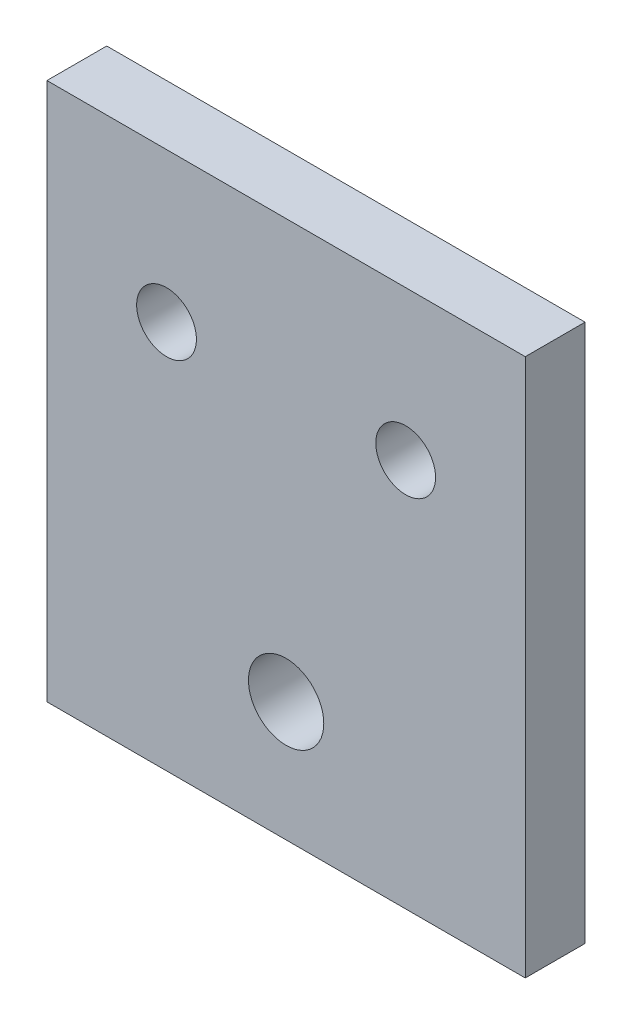
ISO-10303-21;
HEADER;
FILE_DESCRIPTION(('STEP AP214'),'2;1');
FILE_NAME('part.step','',(''),(''),'','','');
FILE_SCHEMA(('AUTOMOTIVE_DESIGN { 1 0 10303 214 1 1 1 1 }'));
ENDSEC;
DATA;
#1=APPLICATION_CONTEXT('core data for automotive mechanical design processes');
#2=APPLICATION_PROTOCOL_DEFINITION('international standard','automotive_design',2000,#1);
#3=PRODUCT_CONTEXT('',#1,'mechanical');
#4=PRODUCT('Part','Part','',(#3));
#5=PRODUCT_RELATED_PRODUCT_CATEGORY('part','',(#4));
#6=PRODUCT_DEFINITION_FORMATION('','',#4);
#7=PRODUCT_DEFINITION_CONTEXT('part definition',#1,'design');
#8=PRODUCT_DEFINITION('design','',#6,#7);
#9=PRODUCT_DEFINITION_SHAPE('','',#8);
#10=(LENGTH_UNIT() NAMED_UNIT(*) SI_UNIT(.MILLI.,.METRE.));
#11=(NAMED_UNIT(*) PLANE_ANGLE_UNIT() SI_UNIT($,.RADIAN.));
#12=(NAMED_UNIT(*) SI_UNIT($,.STERADIAN.) SOLID_ANGLE_UNIT());
#13=UNCERTAINTY_MEASURE_WITH_UNIT(LENGTH_MEASURE(1.E-05),#10,'distance_accuracy_value','');
#14=(GEOMETRIC_REPRESENTATION_CONTEXT(3) GLOBAL_UNCERTAINTY_ASSIGNED_CONTEXT((#13)) GLOBAL_UNIT_ASSIGNED_CONTEXT((#10,
#11,#12)) REPRESENTATION_CONTEXT('',''));
#15=CARTESIAN_POINT('',(0.,0.,0.));
#16=DIRECTION('',(0.,0.,1.));
#17=DIRECTION('',(1.,0.,0.));
#18=AXIS2_PLACEMENT_3D('',#15,#16,#17);
#19=CARTESIAN_POINT('',(25.4,-28.575,6.35));
#20=DIRECTION('',(-1.,0.,0.));
#21=DIRECTION('',(0.,0.,1.));
#22=AXIS2_PLACEMENT_3D('',#19,#20,#21);
#23=PLANE('',#22);
#24=DIRECTION('',(0.,1.,0.));
#25=VECTOR('',#24,1.);
#26=CARTESIAN_POINT('',(25.4,-28.575,0.));
#27=LINE('',#26,#25);
#28=CARTESIAN_POINT('',(25.4,-28.575,0.));
#29=VERTEX_POINT('',#28);
#30=CARTESIAN_POINT('',(25.4,28.575,0.));
#31=VERTEX_POINT('',#30);
#32=EDGE_CURVE('E95',#29,#31,#27,.T.);
#33=ORIENTED_EDGE('',*,*,#32,.T.);
#34=DIRECTION('',(0.,0.,-1.));
#35=VECTOR('',#34,1.);
#36=CARTESIAN_POINT('',(25.4,28.575,6.35));
#37=LINE('',#36,#35);
#38=CARTESIAN_POINT('',(25.4,28.575,6.35));
#39=VERTEX_POINT('',#38);
#40=EDGE_CURVE('E11',#39,#31,#37,.T.);
#41=ORIENTED_EDGE('',*,*,#40,.F.);
#42=DIRECTION('',(0.,1.,0.));
#43=VECTOR('',#42,1.);
#44=CARTESIAN_POINT('',(25.4,-28.575,6.35));
#45=LINE('',#44,#43);
#46=CARTESIAN_POINT('',(25.4,-28.575,6.35));
#47=VERTEX_POINT('',#46);
#48=EDGE_CURVE('E83',#47,#39,#45,.T.);
#49=ORIENTED_EDGE('',*,*,#48,.F.);
#50=DIRECTION('',(0.,0.,-1.));
#51=VECTOR('',#50,1.);
#52=CARTESIAN_POINT('',(25.4,-28.575,6.35));
#53=LINE('',#52,#51);
#54=EDGE_CURVE('E91',#47,#29,#53,.T.);
#55=ORIENTED_EDGE('',*,*,#54,.T.);
#56=EDGE_LOOP('',(#33,#41,#49,#55));
#57=FACE_BOUND('',#56,.T.);
#58=ADVANCED_FACE('F32',(#57),#23,.F.);
#59=CARTESIAN_POINT('',(-25.4,28.575,6.35));
#60=DIRECTION('',(0.,-1.,0.));
#61=DIRECTION('',(0.,0.,-1.));
#62=AXIS2_PLACEMENT_3D('',#59,#60,#61);
#63=PLANE('',#62);
#64=DIRECTION('',(-1.,0.,0.));
#65=VECTOR('',#64,1.);
#66=CARTESIAN_POINT('',(-25.4,28.575,0.));
#67=LINE('',#66,#65);
#68=CARTESIAN_POINT('',(-25.4,28.575,0.));
#69=VERTEX_POINT('',#68);
#70=EDGE_CURVE('E87',#31,#69,#67,.T.);
#71=ORIENTED_EDGE('',*,*,#70,.T.);
#72=DIRECTION('',(0.,0.,-1.));
#73=VECTOR('',#72,1.);
#74=CARTESIAN_POINT('',(-25.4,28.575,6.35));
#75=LINE('',#74,#73);
#76=CARTESIAN_POINT('',(-25.4,28.575,6.35));
#77=VERTEX_POINT('',#76);
#78=EDGE_CURVE('E40',#77,#69,#75,.T.);
#79=ORIENTED_EDGE('',*,*,#78,.F.);
#80=DIRECTION('',(-1.,0.,0.));
#81=VECTOR('',#80,1.);
#82=CARTESIAN_POINT('',(-25.4,28.575,6.35));
#83=LINE('',#82,#81);
#84=EDGE_CURVE('E78',#39,#77,#83,.T.);
#85=ORIENTED_EDGE('',*,*,#84,.F.);
#86=ORIENTED_EDGE('',*,*,#40,.T.);
#87=EDGE_LOOP('',(#71,#79,#85,#86));
#88=FACE_BOUND('',#87,.T.);
#89=ADVANCED_FACE('F86',(#88),#63,.F.);
#90=CARTESIAN_POINT('',(-25.4,-28.575,6.35));
#91=DIRECTION('',(1.,0.,0.));
#92=DIRECTION('',(0.,0.,-1.));
#93=AXIS2_PLACEMENT_3D('',#90,#91,#92);
#94=PLANE('',#93);
#95=DIRECTION('',(0.,-1.,0.));
#96=VECTOR('',#95,1.);
#97=CARTESIAN_POINT('',(-25.4,-28.575,0.));
#98=LINE('',#97,#96);
#99=CARTESIAN_POINT('',(-25.4,-28.575,0.));
#100=VERTEX_POINT('',#99);
#101=EDGE_CURVE('E65',#69,#100,#98,.T.);
#102=ORIENTED_EDGE('',*,*,#101,.T.);
#103=DIRECTION('',(0.,0.,-1.));
#104=VECTOR('',#103,1.);
#105=CARTESIAN_POINT('',(-25.4,-28.575,6.35));
#106=LINE('',#105,#104);
#107=CARTESIAN_POINT('',(-25.4,-28.575,6.35));
#108=VERTEX_POINT('',#107);
#109=EDGE_CURVE('E88',#108,#100,#106,.T.);
#110=ORIENTED_EDGE('',*,*,#109,.F.);
#111=DIRECTION('',(0.,-1.,0.));
#112=VECTOR('',#111,1.);
#113=CARTESIAN_POINT('',(-25.4,-28.575,6.35));
#114=LINE('',#113,#112);
#115=EDGE_CURVE('E81',#77,#108,#114,.T.);
#116=ORIENTED_EDGE('',*,*,#115,.F.);
#117=ORIENTED_EDGE('',*,*,#78,.T.);
#118=EDGE_LOOP('',(#102,#110,#116,#117));
#119=FACE_BOUND('',#118,.T.);
#120=ADVANCED_FACE('F89',(#119),#94,.F.);
#121=CARTESIAN_POINT('',(-25.4,-28.575,6.35));
#122=DIRECTION('',(0.,1.,0.));
#123=DIRECTION('',(0.,0.,1.));
#124=AXIS2_PLACEMENT_3D('',#121,#122,#123);
#125=PLANE('',#124);
#126=DIRECTION('',(1.,0.,0.));
#127=VECTOR('',#126,1.);
#128=CARTESIAN_POINT('',(-25.4,-28.575,0.));
#129=LINE('',#128,#127);
#130=EDGE_CURVE('E71',#100,#29,#129,.T.);
#131=ORIENTED_EDGE('',*,*,#130,.T.);
#132=ORIENTED_EDGE('',*,*,#54,.F.);
#133=DIRECTION('',(1.,0.,0.));
#134=VECTOR('',#133,1.);
#135=CARTESIAN_POINT('',(-25.4,-28.575,6.35));
#136=LINE('',#135,#134);
#137=EDGE_CURVE('E48',#108,#47,#136,.T.);
#138=ORIENTED_EDGE('',*,*,#137,.F.);
#139=ORIENTED_EDGE('',*,*,#109,.T.);
#140=EDGE_LOOP('',(#131,#132,#138,#139));
#141=FACE_BOUND('',#140,.T.);
#142=ADVANCED_FACE('F103',(#141),#125,.F.);
#143=CARTESIAN_POINT('',(0.,0.,6.35));
#144=DIRECTION('',(0.,0.,-1.));
#145=DIRECTION('',(-1.,0.,0.));
#146=AXIS2_PLACEMENT_3D('',#143,#144,#145);
#147=PLANE('',#146);
#148=CARTESIAN_POINT('',(0.,-15.875,6.35));
#149=DIRECTION('',(0.,0.,1.));
#150=DIRECTION('',(1.,0.,0.));
#151=AXIS2_PLACEMENT_3D('',#148,#149,#150);
#152=CIRCLE('',#151,4.);
#153=CARTESIAN_POINT('',(4.00000000000001,-15.875,6.35));
#154=VERTEX_POINT('',#153);
#155=EDGE_CURVE('E119',#154,#154,#152,.T.);
#156=ORIENTED_EDGE('',*,*,#155,.F.);
#157=EDGE_LOOP('',(#156));
#158=FACE_BOUND('',#157,.T.);
#159=CARTESIAN_POINT('',(-12.7,12.7,6.35));
#160=DIRECTION('',(0.,0.,1.));
#161=DIRECTION('',(1.,0.,0.));
#162=AXIS2_PLACEMENT_3D('',#159,#160,#161);
#163=CIRCLE('',#162,3.175);
#164=CARTESIAN_POINT('',(-9.525,12.7,6.35));
#165=VERTEX_POINT('',#164);
#166=EDGE_CURVE('E112',#165,#165,#163,.T.);
#167=ORIENTED_EDGE('',*,*,#166,.F.);
#168=EDGE_LOOP('',(#167));
#169=FACE_BOUND('',#168,.T.);
#170=CARTESIAN_POINT('',(12.7,12.7,6.35));
#171=DIRECTION('',(0.,0.,1.));
#172=DIRECTION('',(1.,0.,0.));
#173=AXIS2_PLACEMENT_3D('',#170,#171,#172);
#174=CIRCLE('',#173,3.175);
#175=CARTESIAN_POINT('',(15.875,12.7,6.35));
#176=VERTEX_POINT('',#175);
#177=EDGE_CURVE('E113',#176,#176,#174,.T.);
#178=ORIENTED_EDGE('',*,*,#177,.F.);
#179=EDGE_LOOP('',(#178));
#180=FACE_BOUND('',#179,.T.);
#181=ORIENTED_EDGE('',*,*,#48,.T.);
#182=ORIENTED_EDGE('',*,*,#84,.T.);
#183=ORIENTED_EDGE('',*,*,#115,.T.);
#184=ORIENTED_EDGE('',*,*,#137,.T.);
#185=EDGE_LOOP('',(#181,#182,#183,#184));
#186=FACE_BOUND('',#185,.T.);
#187=ADVANCED_FACE('F79',(#158,#169,#180,#186),#147,.F.);
#188=CARTESIAN_POINT('',(0.,0.,0.));
#189=DIRECTION('',(0.,0.,-1.));
#190=DIRECTION('',(-1.,0.,0.));
#191=AXIS2_PLACEMENT_3D('',#188,#189,#190);
#192=PLANE('',#191);
#193=CARTESIAN_POINT('',(0.,-15.875,0.));
#194=DIRECTION('',(0.,0.,-1.));
#195=DIRECTION('',(-1.,0.,0.));
#196=AXIS2_PLACEMENT_3D('',#193,#194,#195);
#197=CIRCLE('',#196,4.);
#198=CARTESIAN_POINT('',(-3.99999999999999,-15.875,0.));
#199=VERTEX_POINT('',#198);
#200=EDGE_CURVE('E98',#199,#199,#197,.F.);
#201=ORIENTED_EDGE('',*,*,#200,.T.);
#202=EDGE_LOOP('',(#201));
#203=FACE_BOUND('',#202,.T.);
#204=CARTESIAN_POINT('',(-12.7,12.7,0.));
#205=DIRECTION('',(0.,0.,-1.));
#206=DIRECTION('',(-1.,0.,0.));
#207=AXIS2_PLACEMENT_3D('',#204,#205,#206);
#208=CIRCLE('',#207,3.175);
#209=CARTESIAN_POINT('',(-15.875,12.7,0.));
#210=VERTEX_POINT('',#209);
#211=EDGE_CURVE('E116',#210,#210,#208,.F.);
#212=ORIENTED_EDGE('',*,*,#211,.T.);
#213=EDGE_LOOP('',(#212));
#214=FACE_BOUND('',#213,.T.);
#215=CARTESIAN_POINT('',(12.7,12.7,0.));
#216=DIRECTION('',(0.,0.,-1.));
#217=DIRECTION('',(-1.,0.,0.));
#218=AXIS2_PLACEMENT_3D('',#215,#216,#217);
#219=CIRCLE('',#218,3.175);
#220=CARTESIAN_POINT('',(9.525,12.7,0.));
#221=VERTEX_POINT('',#220);
#222=EDGE_CURVE('E109',#221,#221,#219,.F.);
#223=ORIENTED_EDGE('',*,*,#222,.T.);
#224=EDGE_LOOP('',(#223));
#225=FACE_BOUND('',#224,.T.);
#226=ORIENTED_EDGE('',*,*,#32,.F.);
#227=ORIENTED_EDGE('',*,*,#130,.F.);
#228=ORIENTED_EDGE('',*,*,#101,.F.);
#229=ORIENTED_EDGE('',*,*,#70,.F.);
#230=EDGE_LOOP('',(#226,#227,#228,#229));
#231=FACE_BOUND('',#230,.T.);
#232=ADVANCED_FACE('F106',(#203,#214,#225,#231),#192,.T.);
#233=CARTESIAN_POINT('',(12.7,12.7,-11.3137084989848));
#234=DIRECTION('',(0.,0.,1.));
#235=DIRECTION('',(1.,0.,0.));
#236=AXIS2_PLACEMENT_3D('',#233,#234,#235);
#237=CYLINDRICAL_SURFACE('',#236,3.175);
#238=ORIENTED_EDGE('',*,*,#177,.T.);
#239=EDGE_LOOP('',(#238));
#240=FACE_BOUND('',#239,.T.);
#241=ORIENTED_EDGE('',*,*,#222,.F.);
#242=EDGE_LOOP('',(#241));
#243=FACE_BOUND('',#242,.T.);
#244=ADVANCED_FACE('F137',(#240,#243),#237,.F.);
#245=CARTESIAN_POINT('',(-12.7,12.7,-11.3137084989848));
#246=DIRECTION('',(0.,0.,1.));
#247=DIRECTION('',(1.,0.,0.));
#248=AXIS2_PLACEMENT_3D('',#245,#246,#247);
#249=CYLINDRICAL_SURFACE('',#248,3.175);
#250=ORIENTED_EDGE('',*,*,#166,.T.);
#251=EDGE_LOOP('',(#250));
#252=FACE_BOUND('',#251,.T.);
#253=ORIENTED_EDGE('',*,*,#211,.F.);
#254=EDGE_LOOP('',(#253));
#255=FACE_BOUND('',#254,.T.);
#256=ADVANCED_FACE('F140',(#252,#255),#249,.F.);
#257=CARTESIAN_POINT('',(0.,-15.875,-11.3137084989848));
#258=DIRECTION('',(0.,0.,1.));
#259=DIRECTION('',(1.,0.,0.));
#260=AXIS2_PLACEMENT_3D('',#257,#258,#259);
#261=CYLINDRICAL_SURFACE('',#260,4.);
#262=ORIENTED_EDGE('',*,*,#155,.T.);
#263=EDGE_LOOP('',(#262));
#264=FACE_BOUND('',#263,.T.);
#265=ORIENTED_EDGE('',*,*,#200,.F.);
#266=EDGE_LOOP('',(#265));
#267=FACE_BOUND('',#266,.T.);
#268=ADVANCED_FACE('F127',(#264,#267),#261,.F.);
#269=CLOSED_SHELL('',(#58,#89,#120,#142,#187,#232,#244,#256,#268));
#270=MANIFOLD_SOLID_BREP('B2',#269);
#271=ADVANCED_BREP_SHAPE_REPRESENTATION('',(#18,#270),#14);
#272=SHAPE_DEFINITION_REPRESENTATION(#9,#271);
ENDSEC;
END-ISO-10303-21;
